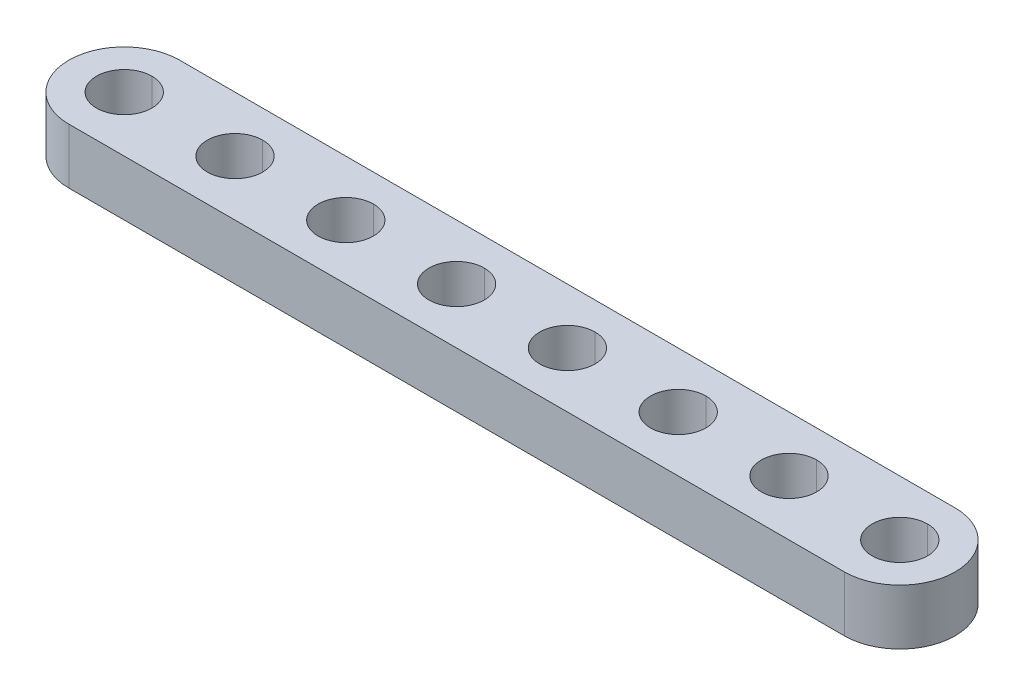
ISO-10303-21;
HEADER;
FILE_DESCRIPTION(('STEP AP214'),'2;1');
FILE_NAME('part.step','',(''),(''),'','','');
FILE_SCHEMA(('AUTOMOTIVE_DESIGN { 1 0 10303 214 1 1 1 1 }'));
ENDSEC;
DATA;
#1=APPLICATION_CONTEXT('core data for automotive mechanical design processes');
#2=APPLICATION_PROTOCOL_DEFINITION('international standard','automotive_design',2000,#1);
#3=PRODUCT_CONTEXT('',#1,'mechanical');
#4=PRODUCT('Part','Part','',(#3));
#5=PRODUCT_RELATED_PRODUCT_CATEGORY('part','',(#4));
#6=PRODUCT_DEFINITION_FORMATION('','',#4);
#7=PRODUCT_DEFINITION_CONTEXT('part definition',#1,'design');
#8=PRODUCT_DEFINITION('design','',#6,#7);
#9=PRODUCT_DEFINITION_SHAPE('','',#8);
#10=(LENGTH_UNIT() NAMED_UNIT(*) SI_UNIT(.MILLI.,.METRE.));
#11=(NAMED_UNIT(*) PLANE_ANGLE_UNIT() SI_UNIT($,.RADIAN.));
#12=(NAMED_UNIT(*) SI_UNIT($,.STERADIAN.) SOLID_ANGLE_UNIT());
#13=UNCERTAINTY_MEASURE_WITH_UNIT(LENGTH_MEASURE(1.E-05),#10,'distance_accuracy_value','');
#14=(GEOMETRIC_REPRESENTATION_CONTEXT(3) GLOBAL_UNCERTAINTY_ASSIGNED_CONTEXT((#13)) GLOBAL_UNIT_ASSIGNED_CONTEXT((#10,
#11,#12)) REPRESENTATION_CONTEXT('',''));
#15=CARTESIAN_POINT('',(0.,0.,0.));
#16=DIRECTION('',(0.,0.,1.));
#17=DIRECTION('',(1.,0.,0.));
#18=AXIS2_PLACEMENT_3D('',#15,#16,#17);
#19=CARTESIAN_POINT('',(28.,4.,0.));
#20=DIRECTION('',(0.,1.,0.));
#21=DIRECTION('',(0.,0.,1.));
#22=AXIS2_PLACEMENT_3D('',#19,#20,#21);
#23=CYLINDRICAL_SURFACE('',#22,2.);
#24=DIRECTION('',(0.,1.,0.));
#25=VECTOR('',#24,1.);
#26=CARTESIAN_POINT('',(28.,4.,-2.));
#27=LINE('',#26,#25);
#28=CARTESIAN_POINT('',(28.,0.,-2.));
#29=VERTEX_POINT('',#28);
#30=CARTESIAN_POINT('',(28.,4.,-2.));
#31=VERTEX_POINT('',#30);
#32=EDGE_CURVE('E223',#29,#31,#27,.T.);
#33=ORIENTED_EDGE('',*,*,#32,.F.);
#34=CARTESIAN_POINT('',(28.,0.,0.));
#35=DIRECTION('',(0.,1.,0.));
#36=DIRECTION('',(0.,0.,1.));
#37=AXIS2_PLACEMENT_3D('',#34,#35,#36);
#38=CIRCLE('',#37,2.);
#39=CARTESIAN_POINT('',(28.,0.,2.));
#40=VERTEX_POINT('',#39);
#41=EDGE_CURVE('E323',#40,#29,#38,.T.);
#42=ORIENTED_EDGE('',*,*,#41,.F.);
#43=DIRECTION('',(0.,1.,0.));
#44=VECTOR('',#43,1.);
#45=CARTESIAN_POINT('',(28.,4.,2.));
#46=LINE('',#45,#44);
#47=CARTESIAN_POINT('',(28.,4.,2.));
#48=VERTEX_POINT('',#47);
#49=EDGE_CURVE('E302',#40,#48,#46,.T.);
#50=ORIENTED_EDGE('',*,*,#49,.T.);
#51=CARTESIAN_POINT('',(28.,4.,0.));
#52=DIRECTION('',(0.,1.,0.));
#53=DIRECTION('',(0.,0.,1.));
#54=AXIS2_PLACEMENT_3D('',#51,#52,#53);
#55=CIRCLE('',#54,2.);
#56=EDGE_CURVE('E229',#48,#31,#55,.T.);
#57=ORIENTED_EDGE('',*,*,#56,.T.);
#58=EDGE_LOOP('',(#33,#42,#50,#57));
#59=FACE_BOUND('',#58,.T.);
#60=ADVANCED_FACE('F15',(#59),#23,.F.);
#61=CARTESIAN_POINT('',(20.,4.,0.));
#62=DIRECTION('',(0.,1.,0.));
#63=DIRECTION('',(0.,0.,1.));
#64=AXIS2_PLACEMENT_3D('',#61,#62,#63);
#65=CYLINDRICAL_SURFACE('',#64,2.);
#66=DIRECTION('',(0.,1.,0.));
#67=VECTOR('',#66,1.);
#68=CARTESIAN_POINT('',(20.,4.,-2.));
#69=LINE('',#68,#67);
#70=CARTESIAN_POINT('',(20.,0.,-2.));
#71=VERTEX_POINT('',#70);
#72=CARTESIAN_POINT('',(20.,4.,-2.));
#73=VERTEX_POINT('',#72);
#74=EDGE_CURVE('E416',#71,#73,#69,.T.);
#75=ORIENTED_EDGE('',*,*,#74,.F.);
#76=CARTESIAN_POINT('',(20.,0.,0.));
#77=DIRECTION('',(0.,1.,0.));
#78=DIRECTION('',(0.,0.,1.));
#79=AXIS2_PLACEMENT_3D('',#76,#77,#78);
#80=CIRCLE('',#79,2.);
#81=CARTESIAN_POINT('',(20.,0.,2.));
#82=VERTEX_POINT('',#81);
#83=EDGE_CURVE('E484',#82,#71,#80,.T.);
#84=ORIENTED_EDGE('',*,*,#83,.F.);
#85=DIRECTION('',(0.,1.,0.));
#86=VECTOR('',#85,1.);
#87=CARTESIAN_POINT('',(20.,4.,2.));
#88=LINE('',#87,#86);
#89=CARTESIAN_POINT('',(20.,4.,2.));
#90=VERTEX_POINT('',#89);
#91=EDGE_CURVE('E426',#82,#90,#88,.T.);
#92=ORIENTED_EDGE('',*,*,#91,.T.);
#93=CARTESIAN_POINT('',(20.,4.,0.));
#94=DIRECTION('',(0.,1.,0.));
#95=DIRECTION('',(0.,0.,1.));
#96=AXIS2_PLACEMENT_3D('',#93,#94,#95);
#97=CIRCLE('',#96,2.);
#98=EDGE_CURVE('E232',#90,#73,#97,.T.);
#99=ORIENTED_EDGE('',*,*,#98,.T.);
#100=EDGE_LOOP('',(#75,#84,#92,#99));
#101=FACE_BOUND('',#100,.T.);
#102=ADVANCED_FACE('F344',(#101),#65,.F.);
#103=CARTESIAN_POINT('',(12.,4.,0.));
#104=DIRECTION('',(0.,1.,0.));
#105=DIRECTION('',(0.,0.,1.));
#106=AXIS2_PLACEMENT_3D('',#103,#104,#105);
#107=CYLINDRICAL_SURFACE('',#106,2.);
#108=DIRECTION('',(0.,1.,0.));
#109=VECTOR('',#108,1.);
#110=CARTESIAN_POINT('',(12.,4.,-2.));
#111=LINE('',#110,#109);
#112=CARTESIAN_POINT('',(12.,0.,-2.));
#113=VERTEX_POINT('',#112);
#114=CARTESIAN_POINT('',(12.,4.,-2.));
#115=VERTEX_POINT('',#114);
#116=EDGE_CURVE('E286',#113,#115,#111,.T.);
#117=ORIENTED_EDGE('',*,*,#116,.F.);
#118=CARTESIAN_POINT('',(12.,0.,0.));
#119=DIRECTION('',(0.,1.,0.));
#120=DIRECTION('',(0.,0.,1.));
#121=AXIS2_PLACEMENT_3D('',#118,#119,#120);
#122=CIRCLE('',#121,2.);
#123=CARTESIAN_POINT('',(12.,0.,2.));
#124=VERTEX_POINT('',#123);
#125=EDGE_CURVE('E445',#124,#113,#122,.T.);
#126=ORIENTED_EDGE('',*,*,#125,.F.);
#127=DIRECTION('',(0.,1.,0.));
#128=VECTOR('',#127,1.);
#129=CARTESIAN_POINT('',(12.,4.,2.));
#130=LINE('',#129,#128);
#131=CARTESIAN_POINT('',(12.,4.,2.));
#132=VERTEX_POINT('',#131);
#133=EDGE_CURVE('E215',#124,#132,#130,.T.);
#134=ORIENTED_EDGE('',*,*,#133,.T.);
#135=CARTESIAN_POINT('',(12.,4.,0.));
#136=DIRECTION('',(0.,1.,0.));
#137=DIRECTION('',(0.,0.,1.));
#138=AXIS2_PLACEMENT_3D('',#135,#136,#137);
#139=CIRCLE('',#138,2.);
#140=EDGE_CURVE('E197',#132,#115,#139,.T.);
#141=ORIENTED_EDGE('',*,*,#140,.T.);
#142=EDGE_LOOP('',(#117,#126,#134,#141));
#143=FACE_BOUND('',#142,.T.);
#144=ADVANCED_FACE('F349',(#143),#107,.F.);
#145=CARTESIAN_POINT('',(4.,4.,0.));
#146=DIRECTION('',(0.,1.,0.));
#147=DIRECTION('',(0.,0.,1.));
#148=AXIS2_PLACEMENT_3D('',#145,#146,#147);
#149=CYLINDRICAL_SURFACE('',#148,2.);
#150=DIRECTION('',(0.,1.,0.));
#151=VECTOR('',#150,1.);
#152=CARTESIAN_POINT('',(4.,4.,-2.));
#153=LINE('',#152,#151);
#154=CARTESIAN_POINT('',(4.,0.,-2.));
#155=VERTEX_POINT('',#154);
#156=CARTESIAN_POINT('',(4.,4.,-2.));
#157=VERTEX_POINT('',#156);
#158=EDGE_CURVE('E189',#155,#157,#153,.T.);
#159=ORIENTED_EDGE('',*,*,#158,.F.);
#160=CARTESIAN_POINT('',(4.,0.,0.));
#161=DIRECTION('',(0.,1.,0.));
#162=DIRECTION('',(0.,0.,1.));
#163=AXIS2_PLACEMENT_3D('',#160,#161,#162);
#164=CIRCLE('',#163,2.);
#165=CARTESIAN_POINT('',(4.,0.,2.));
#166=VERTEX_POINT('',#165);
#167=EDGE_CURVE('E276',#166,#155,#164,.T.);
#168=ORIENTED_EDGE('',*,*,#167,.F.);
#169=DIRECTION('',(0.,1.,0.));
#170=VECTOR('',#169,1.);
#171=CARTESIAN_POINT('',(4.,4.,2.));
#172=LINE('',#171,#170);
#173=CARTESIAN_POINT('',(4.,4.,2.));
#174=VERTEX_POINT('',#173);
#175=EDGE_CURVE('E192',#166,#174,#172,.T.);
#176=ORIENTED_EDGE('',*,*,#175,.T.);
#177=CARTESIAN_POINT('',(4.,4.,0.));
#178=DIRECTION('',(0.,1.,0.));
#179=DIRECTION('',(0.,0.,1.));
#180=AXIS2_PLACEMENT_3D('',#177,#178,#179);
#181=CIRCLE('',#180,2.);
#182=EDGE_CURVE('E185',#174,#157,#181,.T.);
#183=ORIENTED_EDGE('',*,*,#182,.T.);
#184=EDGE_LOOP('',(#159,#168,#176,#183));
#185=FACE_BOUND('',#184,.T.);
#186=ADVANCED_FACE('F187',(#185),#149,.F.);
#187=CARTESIAN_POINT('',(-4.,4.,0.));
#188=DIRECTION('',(0.,1.,0.));
#189=DIRECTION('',(0.,0.,1.));
#190=AXIS2_PLACEMENT_3D('',#187,#188,#189);
#191=CYLINDRICAL_SURFACE('',#190,2.);
#192=DIRECTION('',(0.,1.,0.));
#193=VECTOR('',#192,1.);
#194=CARTESIAN_POINT('',(-4.,4.,-2.));
#195=LINE('',#194,#193);
#196=CARTESIAN_POINT('',(-4.,0.,-2.));
#197=VERTEX_POINT('',#196);
#198=CARTESIAN_POINT('',(-4.,4.,-2.));
#199=VERTEX_POINT('',#198);
#200=EDGE_CURVE('E291',#197,#199,#195,.T.);
#201=ORIENTED_EDGE('',*,*,#200,.F.);
#202=CARTESIAN_POINT('',(-4.,0.,0.));
#203=DIRECTION('',(0.,1.,0.));
#204=DIRECTION('',(0.,0.,1.));
#205=AXIS2_PLACEMENT_3D('',#202,#203,#204);
#206=CIRCLE('',#205,2.);
#207=CARTESIAN_POINT('',(-4.,0.,2.));
#208=VERTEX_POINT('',#207);
#209=EDGE_CURVE('E430',#208,#197,#206,.T.);
#210=ORIENTED_EDGE('',*,*,#209,.F.);
#211=DIRECTION('',(0.,1.,0.));
#212=VECTOR('',#211,1.);
#213=CARTESIAN_POINT('',(-4.,4.,2.));
#214=LINE('',#213,#212);
#215=CARTESIAN_POINT('',(-4.,4.,2.));
#216=VERTEX_POINT('',#215);
#217=EDGE_CURVE('E281',#208,#216,#214,.T.);
#218=ORIENTED_EDGE('',*,*,#217,.T.);
#219=CARTESIAN_POINT('',(-4.,4.,0.));
#220=DIRECTION('',(0.,1.,0.));
#221=DIRECTION('',(0.,0.,1.));
#222=AXIS2_PLACEMENT_3D('',#219,#220,#221);
#223=CIRCLE('',#222,2.);
#224=EDGE_CURVE('E196',#216,#199,#223,.T.);
#225=ORIENTED_EDGE('',*,*,#224,.T.);
#226=EDGE_LOOP('',(#201,#210,#218,#225));
#227=FACE_BOUND('',#226,.T.);
#228=ADVANCED_FACE('F356',(#227),#191,.F.);
#229=CARTESIAN_POINT('',(-12.,4.,0.));
#230=DIRECTION('',(0.,1.,0.));
#231=DIRECTION('',(0.,0.,1.));
#232=AXIS2_PLACEMENT_3D('',#229,#230,#231);
#233=CYLINDRICAL_SURFACE('',#232,2.);
#234=DIRECTION('',(0.,1.,0.));
#235=VECTOR('',#234,1.);
#236=CARTESIAN_POINT('',(-12.,4.,-2.));
#237=LINE('',#236,#235);
#238=CARTESIAN_POINT('',(-12.,0.,-2.));
#239=VERTEX_POINT('',#238);
#240=CARTESIAN_POINT('',(-12.,4.,-2.));
#241=VERTEX_POINT('',#240);
#242=EDGE_CURVE('E280',#239,#241,#237,.T.);
#243=ORIENTED_EDGE('',*,*,#242,.F.);
#244=CARTESIAN_POINT('',(-12.,0.,0.));
#245=DIRECTION('',(0.,1.,0.));
#246=DIRECTION('',(0.,0.,1.));
#247=AXIS2_PLACEMENT_3D('',#244,#245,#246);
#248=CIRCLE('',#247,2.);
#249=CARTESIAN_POINT('',(-12.,0.,2.));
#250=VERTEX_POINT('',#249);
#251=EDGE_CURVE('E132',#250,#239,#248,.T.);
#252=ORIENTED_EDGE('',*,*,#251,.F.);
#253=DIRECTION('',(0.,1.,0.));
#254=VECTOR('',#253,1.);
#255=CARTESIAN_POINT('',(-12.,4.,2.));
#256=LINE('',#255,#254);
#257=CARTESIAN_POINT('',(-12.,4.,2.));
#258=VERTEX_POINT('',#257);
#259=EDGE_CURVE('E242',#250,#258,#256,.T.);
#260=ORIENTED_EDGE('',*,*,#259,.T.);
#261=CARTESIAN_POINT('',(-12.,4.,0.));
#262=DIRECTION('',(0.,1.,0.));
#263=DIRECTION('',(0.,0.,1.));
#264=AXIS2_PLACEMENT_3D('',#261,#262,#263);
#265=CIRCLE('',#264,2.);
#266=EDGE_CURVE('E408',#258,#241,#265,.T.);
#267=ORIENTED_EDGE('',*,*,#266,.T.);
#268=EDGE_LOOP('',(#243,#252,#260,#267));
#269=FACE_BOUND('',#268,.T.);
#270=ADVANCED_FACE('F359',(#269),#233,.F.);
#271=CARTESIAN_POINT('',(-20.,4.,0.));
#272=DIRECTION('',(0.,1.,0.));
#273=DIRECTION('',(0.,0.,1.));
#274=AXIS2_PLACEMENT_3D('',#271,#272,#273);
#275=CYLINDRICAL_SURFACE('',#274,2.);
#276=DIRECTION('',(0.,1.,0.));
#277=VECTOR('',#276,1.);
#278=CARTESIAN_POINT('',(-20.,4.,-2.));
#279=LINE('',#278,#277);
#280=CARTESIAN_POINT('',(-20.,0.,-2.));
#281=VERTEX_POINT('',#280);
#282=CARTESIAN_POINT('',(-20.,4.,-2.));
#283=VERTEX_POINT('',#282);
#284=EDGE_CURVE('E19',#281,#283,#279,.T.);
#285=ORIENTED_EDGE('',*,*,#284,.F.);
#286=CARTESIAN_POINT('',(-20.,0.,0.));
#287=DIRECTION('',(0.,1.,0.));
#288=DIRECTION('',(0.,0.,1.));
#289=AXIS2_PLACEMENT_3D('',#286,#287,#288);
#290=CIRCLE('',#289,2.);
#291=CARTESIAN_POINT('',(-20.,0.,2.));
#292=VERTEX_POINT('',#291);
#293=EDGE_CURVE('E26',#292,#281,#290,.T.);
#294=ORIENTED_EDGE('',*,*,#293,.F.);
#295=DIRECTION('',(0.,1.,0.));
#296=VECTOR('',#295,1.);
#297=CARTESIAN_POINT('',(-20.,4.,2.));
#298=LINE('',#297,#296);
#299=CARTESIAN_POINT('',(-20.,4.,2.));
#300=VERTEX_POINT('',#299);
#301=EDGE_CURVE('E392',#292,#300,#298,.T.);
#302=ORIENTED_EDGE('',*,*,#301,.T.);
#303=CARTESIAN_POINT('',(-20.,4.,0.));
#304=DIRECTION('',(0.,1.,0.));
#305=DIRECTION('',(0.,0.,1.));
#306=AXIS2_PLACEMENT_3D('',#303,#304,#305);
#307=CIRCLE('',#306,2.);
#308=EDGE_CURVE('E410',#300,#283,#307,.T.);
#309=ORIENTED_EDGE('',*,*,#308,.T.);
#310=EDGE_LOOP('',(#285,#294,#302,#309));
#311=FACE_BOUND('',#310,.T.);
#312=ADVANCED_FACE('F362',(#311),#275,.F.);
#313=CARTESIAN_POINT('',(-28.,4.,0.));
#314=DIRECTION('',(0.,1.,0.));
#315=DIRECTION('',(0.,0.,1.));
#316=AXIS2_PLACEMENT_3D('',#313,#314,#315);
#317=CYLINDRICAL_SURFACE('',#316,2.);
#318=DIRECTION('',(0.,1.,0.));
#319=VECTOR('',#318,1.);
#320=CARTESIAN_POINT('',(-28.,4.,-2.));
#321=LINE('',#320,#319);
#322=CARTESIAN_POINT('',(-28.,0.,-2.));
#323=VERTEX_POINT('',#322);
#324=CARTESIAN_POINT('',(-28.,4.,-2.));
#325=VERTEX_POINT('',#324);
#326=EDGE_CURVE('E233',#323,#325,#321,.T.);
#327=ORIENTED_EDGE('',*,*,#326,.F.);
#328=CARTESIAN_POINT('',(-28.,0.,0.));
#329=DIRECTION('',(0.,1.,0.));
#330=DIRECTION('',(0.,0.,1.));
#331=AXIS2_PLACEMENT_3D('',#328,#329,#330);
#332=CIRCLE('',#331,2.);
#333=CARTESIAN_POINT('',(-28.,0.,2.));
#334=VERTEX_POINT('',#333);
#335=EDGE_CURVE('E10',#334,#323,#332,.T.);
#336=ORIENTED_EDGE('',*,*,#335,.F.);
#337=DIRECTION('',(0.,1.,0.));
#338=VECTOR('',#337,1.);
#339=CARTESIAN_POINT('',(-28.,4.,2.));
#340=LINE('',#339,#338);
#341=CARTESIAN_POINT('',(-28.,4.,2.));
#342=VERTEX_POINT('',#341);
#343=EDGE_CURVE('E294',#334,#342,#340,.T.);
#344=ORIENTED_EDGE('',*,*,#343,.T.);
#345=CARTESIAN_POINT('',(-28.,4.,0.));
#346=DIRECTION('',(0.,1.,0.));
#347=DIRECTION('',(0.,0.,1.));
#348=AXIS2_PLACEMENT_3D('',#345,#346,#347);
#349=CIRCLE('',#348,2.);
#350=EDGE_CURVE('E386',#342,#325,#349,.T.);
#351=ORIENTED_EDGE('',*,*,#350,.T.);
#352=EDGE_LOOP('',(#327,#336,#344,#351));
#353=FACE_BOUND('',#352,.T.);
#354=ADVANCED_FACE('F337',(#353),#317,.F.);
#355=CARTESIAN_POINT('',(-28.,0.,0.));
#356=DIRECTION('',(0.,1.,0.));
#357=DIRECTION('',(1.,0.,0.));
#358=AXIS2_PLACEMENT_3D('',#355,#356,#357);
#359=PLANE('',#358);
#360=ORIENTED_EDGE('',*,*,#335,.T.);
#361=CARTESIAN_POINT('',(-28.,0.,0.));
#362=DIRECTION('',(0.,1.,0.));
#363=DIRECTION('',(0.,0.,1.));
#364=AXIS2_PLACEMENT_3D('',#361,#362,#363);
#365=CIRCLE('',#364,2.);
#366=EDGE_CURVE('E238',#323,#334,#365,.T.);
#367=ORIENTED_EDGE('',*,*,#366,.T.);
#368=EDGE_LOOP('',(#360,#367));
#369=FACE_BOUND('',#368,.T.);
#370=ORIENTED_EDGE('',*,*,#293,.T.);
#371=CARTESIAN_POINT('',(-20.,0.,0.));
#372=DIRECTION('',(0.,1.,0.));
#373=DIRECTION('',(0.,0.,1.));
#374=AXIS2_PLACEMENT_3D('',#371,#372,#373);
#375=CIRCLE('',#374,2.);
#376=EDGE_CURVE('E239',#281,#292,#375,.T.);
#377=ORIENTED_EDGE('',*,*,#376,.T.);
#378=EDGE_LOOP('',(#370,#377));
#379=FACE_BOUND('',#378,.T.);
#380=ORIENTED_EDGE('',*,*,#251,.T.);
#381=CARTESIAN_POINT('',(-12.,0.,0.));
#382=DIRECTION('',(0.,1.,0.));
#383=DIRECTION('',(0.,0.,1.));
#384=AXIS2_PLACEMENT_3D('',#381,#382,#383);
#385=CIRCLE('',#384,2.);
#386=EDGE_CURVE('E278',#239,#250,#385,.T.);
#387=ORIENTED_EDGE('',*,*,#386,.T.);
#388=EDGE_LOOP('',(#380,#387));
#389=FACE_BOUND('',#388,.T.);
#390=ORIENTED_EDGE('',*,*,#209,.T.);
#391=CARTESIAN_POINT('',(-4.,0.,0.));
#392=DIRECTION('',(0.,1.,0.));
#393=DIRECTION('',(0.,0.,1.));
#394=AXIS2_PLACEMENT_3D('',#391,#392,#393);
#395=CIRCLE('',#394,2.);
#396=EDGE_CURVE('E287',#197,#208,#395,.T.);
#397=ORIENTED_EDGE('',*,*,#396,.T.);
#398=EDGE_LOOP('',(#390,#397));
#399=FACE_BOUND('',#398,.T.);
#400=ORIENTED_EDGE('',*,*,#167,.T.);
#401=CARTESIAN_POINT('',(4.,0.,0.));
#402=DIRECTION('',(0.,1.,0.));
#403=DIRECTION('',(0.,0.,1.));
#404=AXIS2_PLACEMENT_3D('',#401,#402,#403);
#405=CIRCLE('',#404,2.);
#406=EDGE_CURVE('E207',#155,#166,#405,.T.);
#407=ORIENTED_EDGE('',*,*,#406,.T.);
#408=EDGE_LOOP('',(#400,#407));
#409=FACE_BOUND('',#408,.T.);
#410=ORIENTED_EDGE('',*,*,#125,.T.);
#411=CARTESIAN_POINT('',(12.,0.,0.));
#412=DIRECTION('',(0.,1.,0.));
#413=DIRECTION('',(0.,0.,1.));
#414=AXIS2_PLACEMENT_3D('',#411,#412,#413);
#415=CIRCLE('',#414,2.);
#416=EDGE_CURVE('E420',#113,#124,#415,.T.);
#417=ORIENTED_EDGE('',*,*,#416,.T.);
#418=EDGE_LOOP('',(#410,#417));
#419=FACE_BOUND('',#418,.T.);
#420=ORIENTED_EDGE('',*,*,#83,.T.);
#421=CARTESIAN_POINT('',(20.,0.,0.));
#422=DIRECTION('',(0.,1.,0.));
#423=DIRECTION('',(0.,0.,1.));
#424=AXIS2_PLACEMENT_3D('',#421,#422,#423);
#425=CIRCLE('',#424,2.);
#426=EDGE_CURVE('E412',#71,#82,#425,.T.);
#427=ORIENTED_EDGE('',*,*,#426,.T.);
#428=EDGE_LOOP('',(#420,#427));
#429=FACE_BOUND('',#428,.T.);
#430=ORIENTED_EDGE('',*,*,#41,.T.);
#431=CARTESIAN_POINT('',(28.,0.,0.));
#432=DIRECTION('',(0.,1.,0.));
#433=DIRECTION('',(0.,0.,1.));
#434=AXIS2_PLACEMENT_3D('',#431,#432,#433);
#435=CIRCLE('',#434,2.);
#436=EDGE_CURVE('E220',#29,#40,#435,.T.);
#437=ORIENTED_EDGE('',*,*,#436,.T.);
#438=EDGE_LOOP('',(#430,#437));
#439=FACE_BOUND('',#438,.T.);
#440=CARTESIAN_POINT('',(-28.,0.,0.));
#441=DIRECTION('',(0.,1.,0.));
#442=DIRECTION('',(0.,0.,1.));
#443=AXIS2_PLACEMENT_3D('',#440,#441,#442);
#444=CIRCLE('',#443,4.);
#445=CARTESIAN_POINT('',(-28.,0.,-4.));
#446=VERTEX_POINT('',#445);
#447=CARTESIAN_POINT('',(-28.,0.,4.));
#448=VERTEX_POINT('',#447);
#449=EDGE_CURVE('E272',#446,#448,#444,.T.);
#450=ORIENTED_EDGE('',*,*,#449,.F.);
#451=DIRECTION('',(-1.,0.,0.));
#452=VECTOR('',#451,1.);
#453=CARTESIAN_POINT('',(-28.,0.,-4.));
#454=LINE('',#453,#452);
#455=CARTESIAN_POINT('',(28.,0.,-4.));
#456=VERTEX_POINT('',#455);
#457=EDGE_CURVE('E227',#456,#446,#454,.T.);
#458=ORIENTED_EDGE('',*,*,#457,.F.);
#459=CARTESIAN_POINT('',(28.,0.,0.));
#460=DIRECTION('',(0.,1.,0.));
#461=DIRECTION('',(0.,0.,1.));
#462=AXIS2_PLACEMENT_3D('',#459,#460,#461);
#463=CIRCLE('',#462,4.);
#464=CARTESIAN_POINT('',(28.,0.,4.));
#465=VERTEX_POINT('',#464);
#466=EDGE_CURVE('E307',#465,#456,#463,.T.);
#467=ORIENTED_EDGE('',*,*,#466,.F.);
#468=DIRECTION('',(1.,0.,0.));
#469=VECTOR('',#468,1.);
#470=CARTESIAN_POINT('',(-28.,0.,4.));
#471=LINE('',#470,#469);
#472=EDGE_CURVE('E246',#448,#465,#471,.T.);
#473=ORIENTED_EDGE('',*,*,#472,.F.);
#474=EDGE_LOOP('',(#450,#458,#467,#473));
#475=FACE_BOUND('',#474,.T.);
#476=ADVANCED_FACE('F327',(#369,#379,#389,#399,#409,#419,#429,#439,#475),#359,.F.);
#477=CARTESIAN_POINT('',(-28.,4.,0.));
#478=DIRECTION('',(0.,1.,0.));
#479=DIRECTION('',(1.,0.,0.));
#480=AXIS2_PLACEMENT_3D('',#477,#478,#479);
#481=PLANE('',#480);
#482=ORIENTED_EDGE('',*,*,#350,.F.);
#483=CARTESIAN_POINT('',(-28.,4.,0.));
#484=DIRECTION('',(0.,1.,0.));
#485=DIRECTION('',(0.,0.,1.));
#486=AXIS2_PLACEMENT_3D('',#483,#484,#485);
#487=CIRCLE('',#486,2.);
#488=EDGE_CURVE('E237',#325,#342,#487,.T.);
#489=ORIENTED_EDGE('',*,*,#488,.F.);
#490=EDGE_LOOP('',(#482,#489));
#491=FACE_BOUND('',#490,.T.);
#492=ORIENTED_EDGE('',*,*,#308,.F.);
#493=CARTESIAN_POINT('',(-20.,4.,0.));
#494=DIRECTION('',(0.,1.,0.));
#495=DIRECTION('',(0.,0.,1.));
#496=AXIS2_PLACEMENT_3D('',#493,#494,#495);
#497=CIRCLE('',#496,2.);
#498=EDGE_CURVE('E400',#283,#300,#497,.T.);
#499=ORIENTED_EDGE('',*,*,#498,.F.);
#500=EDGE_LOOP('',(#492,#499));
#501=FACE_BOUND('',#500,.T.);
#502=ORIENTED_EDGE('',*,*,#266,.F.);
#503=CARTESIAN_POINT('',(-12.,4.,0.));
#504=DIRECTION('',(0.,1.,0.));
#505=DIRECTION('',(0.,0.,1.));
#506=AXIS2_PLACEMENT_3D('',#503,#504,#505);
#507=CIRCLE('',#506,2.);
#508=EDGE_CURVE('E306',#241,#258,#507,.T.);
#509=ORIENTED_EDGE('',*,*,#508,.F.);
#510=EDGE_LOOP('',(#502,#509));
#511=FACE_BOUND('',#510,.T.);
#512=ORIENTED_EDGE('',*,*,#224,.F.);
#513=CARTESIAN_POINT('',(-4.,4.,0.));
#514=DIRECTION('',(0.,1.,0.));
#515=DIRECTION('',(0.,0.,1.));
#516=AXIS2_PLACEMENT_3D('',#513,#514,#515);
#517=CIRCLE('',#516,2.);
#518=EDGE_CURVE('E464',#199,#216,#517,.T.);
#519=ORIENTED_EDGE('',*,*,#518,.F.);
#520=EDGE_LOOP('',(#512,#519));
#521=FACE_BOUND('',#520,.T.);
#522=ORIENTED_EDGE('',*,*,#182,.F.);
#523=CARTESIAN_POINT('',(4.,4.,0.));
#524=DIRECTION('',(0.,1.,0.));
#525=DIRECTION('',(0.,0.,1.));
#526=AXIS2_PLACEMENT_3D('',#523,#524,#525);
#527=CIRCLE('',#526,2.);
#528=EDGE_CURVE('E199',#157,#174,#527,.T.);
#529=ORIENTED_EDGE('',*,*,#528,.F.);
#530=EDGE_LOOP('',(#522,#529));
#531=FACE_BOUND('',#530,.T.);
#532=ORIENTED_EDGE('',*,*,#140,.F.);
#533=CARTESIAN_POINT('',(12.,4.,0.));
#534=DIRECTION('',(0.,1.,0.));
#535=DIRECTION('',(0.,0.,1.));
#536=AXIS2_PLACEMENT_3D('',#533,#534,#535);
#537=CIRCLE('',#536,2.);
#538=EDGE_CURVE('E282',#115,#132,#537,.T.);
#539=ORIENTED_EDGE('',*,*,#538,.F.);
#540=EDGE_LOOP('',(#532,#539));
#541=FACE_BOUND('',#540,.T.);
#542=ORIENTED_EDGE('',*,*,#98,.F.);
#543=CARTESIAN_POINT('',(20.,4.,0.));
#544=DIRECTION('',(0.,1.,0.));
#545=DIRECTION('',(0.,0.,1.));
#546=AXIS2_PLACEMENT_3D('',#543,#544,#545);
#547=CIRCLE('',#546,2.);
#548=EDGE_CURVE('E451',#73,#90,#547,.T.);
#549=ORIENTED_EDGE('',*,*,#548,.F.);
#550=EDGE_LOOP('',(#542,#549));
#551=FACE_BOUND('',#550,.T.);
#552=ORIENTED_EDGE('',*,*,#56,.F.);
#553=CARTESIAN_POINT('',(28.,4.,0.));
#554=DIRECTION('',(0.,1.,0.));
#555=DIRECTION('',(0.,0.,1.));
#556=AXIS2_PLACEMENT_3D('',#553,#554,#555);
#557=CIRCLE('',#556,2.);
#558=EDGE_CURVE('E298',#31,#48,#557,.T.);
#559=ORIENTED_EDGE('',*,*,#558,.F.);
#560=EDGE_LOOP('',(#552,#559));
#561=FACE_BOUND('',#560,.T.);
#562=CARTESIAN_POINT('',(-28.,4.,0.));
#563=DIRECTION('',(0.,1.,0.));
#564=DIRECTION('',(0.,0.,1.));
#565=AXIS2_PLACEMENT_3D('',#562,#563,#564);
#566=CIRCLE('',#565,4.);
#567=CARTESIAN_POINT('',(-28.,4.,-4.));
#568=VERTEX_POINT('',#567);
#569=CARTESIAN_POINT('',(-28.,4.,4.));
#570=VERTEX_POINT('',#569);
#571=EDGE_CURVE('E247',#568,#570,#566,.T.);
#572=ORIENTED_EDGE('',*,*,#571,.T.);
#573=DIRECTION('',(1.,0.,0.));
#574=VECTOR('',#573,1.);
#575=CARTESIAN_POINT('',(-28.,4.,4.));
#576=LINE('',#575,#574);
#577=CARTESIAN_POINT('',(28.,4.,4.));
#578=VERTEX_POINT('',#577);
#579=EDGE_CURVE('E310',#570,#578,#576,.T.);
#580=ORIENTED_EDGE('',*,*,#579,.T.);
#581=CARTESIAN_POINT('',(28.,4.,0.));
#582=DIRECTION('',(0.,1.,0.));
#583=DIRECTION('',(0.,0.,1.));
#584=AXIS2_PLACEMENT_3D('',#581,#582,#583);
#585=CIRCLE('',#584,4.);
#586=CARTESIAN_POINT('',(28.,4.,-4.));
#587=VERTEX_POINT('',#586);
#588=EDGE_CURVE('E224',#578,#587,#585,.T.);
#589=ORIENTED_EDGE('',*,*,#588,.T.);
#590=DIRECTION('',(-1.,0.,0.));
#591=VECTOR('',#590,1.);
#592=CARTESIAN_POINT('',(-28.,4.,-4.));
#593=LINE('',#592,#591);
#594=EDGE_CURVE('E41',#587,#568,#593,.T.);
#595=ORIENTED_EDGE('',*,*,#594,.T.);
#596=EDGE_LOOP('',(#572,#580,#589,#595));
#597=FACE_BOUND('',#596,.T.);
#598=ADVANCED_FACE('F200',(#491,#501,#511,#521,#531,#541,#551,#561,#597),#481,.T.);
#599=CARTESIAN_POINT('',(-28.,4.,-4.));
#600=DIRECTION('',(0.,0.,1.));
#601=DIRECTION('',(1.,0.,0.));
#602=AXIS2_PLACEMENT_3D('',#599,#600,#601);
#603=PLANE('',#602);
#604=ORIENTED_EDGE('',*,*,#457,.T.);
#605=DIRECTION('',(0.,-1.,0.));
#606=VECTOR('',#605,1.);
#607=CARTESIAN_POINT('',(-28.,4.,-4.));
#608=LINE('',#607,#606);
#609=EDGE_CURVE('E243',#568,#446,#608,.T.);
#610=ORIENTED_EDGE('',*,*,#609,.F.);
#611=ORIENTED_EDGE('',*,*,#594,.F.);
#612=DIRECTION('',(0.,-1.,0.));
#613=VECTOR('',#612,1.);
#614=CARTESIAN_POINT('',(28.,4.,-4.));
#615=LINE('',#614,#613);
#616=EDGE_CURVE('E228',#587,#456,#615,.T.);
#617=ORIENTED_EDGE('',*,*,#616,.T.);
#618=EDGE_LOOP('',(#604,#610,#611,#617));
#619=FACE_BOUND('',#618,.T.);
#620=ADVANCED_FACE('F326',(#619),#603,.F.);
#621=CARTESIAN_POINT('',(28.,4.,0.));
#622=DIRECTION('',(0.,-1.,0.));
#623=DIRECTION('',(0.,0.,-1.));
#624=AXIS2_PLACEMENT_3D('',#621,#622,#623);
#625=CYLINDRICAL_SURFACE('',#624,4.);
#626=ORIENTED_EDGE('',*,*,#466,.T.);
#627=ORIENTED_EDGE('',*,*,#616,.F.);
#628=ORIENTED_EDGE('',*,*,#588,.F.);
#629=DIRECTION('',(0.,-1.,0.));
#630=VECTOR('',#629,1.);
#631=CARTESIAN_POINT('',(28.,4.,4.));
#632=LINE('',#631,#630);
#633=EDGE_CURVE('E257',#578,#465,#632,.T.);
#634=ORIENTED_EDGE('',*,*,#633,.T.);
#635=EDGE_LOOP('',(#626,#627,#628,#634));
#636=FACE_BOUND('',#635,.T.);
#637=ADVANCED_FACE('F335',(#636),#625,.T.);
#638=CARTESIAN_POINT('',(-28.,4.,4.));
#639=DIRECTION('',(0.,0.,-1.));
#640=DIRECTION('',(0.,-1.,0.));
#641=AXIS2_PLACEMENT_3D('',#638,#639,#640);
#642=PLANE('',#641);
#643=ORIENTED_EDGE('',*,*,#472,.T.);
#644=ORIENTED_EDGE('',*,*,#633,.F.);
#645=ORIENTED_EDGE('',*,*,#579,.F.);
#646=DIRECTION('',(0.,-1.,0.));
#647=VECTOR('',#646,1.);
#648=CARTESIAN_POINT('',(-28.,4.,4.));
#649=LINE('',#648,#647);
#650=EDGE_CURVE('E261',#570,#448,#649,.T.);
#651=ORIENTED_EDGE('',*,*,#650,.T.);
#652=EDGE_LOOP('',(#643,#644,#645,#651));
#653=FACE_BOUND('',#652,.T.);
#654=ADVANCED_FACE('F612',(#653),#642,.F.);
#655=CARTESIAN_POINT('',(-28.,4.,0.));
#656=DIRECTION('',(0.,-1.,0.));
#657=DIRECTION('',(0.,0.,-1.));
#658=AXIS2_PLACEMENT_3D('',#655,#656,#657);
#659=CYLINDRICAL_SURFACE('',#658,4.);
#660=ORIENTED_EDGE('',*,*,#449,.T.);
#661=ORIENTED_EDGE('',*,*,#650,.F.);
#662=ORIENTED_EDGE('',*,*,#571,.F.);
#663=ORIENTED_EDGE('',*,*,#609,.T.);
#664=EDGE_LOOP('',(#660,#661,#662,#663));
#665=FACE_BOUND('',#664,.T.);
#666=ADVANCED_FACE('F616',(#665),#659,.T.);
#667=CARTESIAN_POINT('',(-28.,4.,0.));
#668=DIRECTION('',(0.,1.,0.));
#669=DIRECTION('',(0.,0.,1.));
#670=AXIS2_PLACEMENT_3D('',#667,#668,#669);
#671=CYLINDRICAL_SURFACE('',#670,2.);
#672=ORIENTED_EDGE('',*,*,#366,.F.);
#673=ORIENTED_EDGE('',*,*,#326,.T.);
#674=ORIENTED_EDGE('',*,*,#488,.T.);
#675=ORIENTED_EDGE('',*,*,#343,.F.);
#676=EDGE_LOOP('',(#672,#673,#674,#675));
#677=FACE_BOUND('',#676,.T.);
#678=ADVANCED_FACE('F17',(#677),#671,.F.);
#679=CARTESIAN_POINT('',(-20.,4.,0.));
#680=DIRECTION('',(0.,1.,0.));
#681=DIRECTION('',(0.,0.,1.));
#682=AXIS2_PLACEMENT_3D('',#679,#680,#681);
#683=CYLINDRICAL_SURFACE('',#682,2.);
#684=ORIENTED_EDGE('',*,*,#376,.F.);
#685=ORIENTED_EDGE('',*,*,#284,.T.);
#686=ORIENTED_EDGE('',*,*,#498,.T.);
#687=ORIENTED_EDGE('',*,*,#301,.F.);
#688=EDGE_LOOP('',(#684,#685,#686,#687));
#689=FACE_BOUND('',#688,.T.);
#690=ADVANCED_FACE('F622',(#689),#683,.F.);
#691=CARTESIAN_POINT('',(-12.,4.,0.));
#692=DIRECTION('',(0.,1.,0.));
#693=DIRECTION('',(0.,0.,1.));
#694=AXIS2_PLACEMENT_3D('',#691,#692,#693);
#695=CYLINDRICAL_SURFACE('',#694,2.);
#696=ORIENTED_EDGE('',*,*,#386,.F.);
#697=ORIENTED_EDGE('',*,*,#242,.T.);
#698=ORIENTED_EDGE('',*,*,#508,.T.);
#699=ORIENTED_EDGE('',*,*,#259,.F.);
#700=EDGE_LOOP('',(#696,#697,#698,#699));
#701=FACE_BOUND('',#700,.T.);
#702=ADVANCED_FACE('F353',(#701),#695,.F.);
#703=CARTESIAN_POINT('',(-4.,4.,0.));
#704=DIRECTION('',(0.,1.,0.));
#705=DIRECTION('',(0.,0.,1.));
#706=AXIS2_PLACEMENT_3D('',#703,#704,#705);
#707=CYLINDRICAL_SURFACE('',#706,2.);
#708=ORIENTED_EDGE('',*,*,#396,.F.);
#709=ORIENTED_EDGE('',*,*,#200,.T.);
#710=ORIENTED_EDGE('',*,*,#518,.T.);
#711=ORIENTED_EDGE('',*,*,#217,.F.);
#712=EDGE_LOOP('',(#708,#709,#710,#711));
#713=FACE_BOUND('',#712,.T.);
#714=ADVANCED_FACE('F364',(#713),#707,.F.);
#715=CARTESIAN_POINT('',(4.,4.,0.));
#716=DIRECTION('',(0.,1.,0.));
#717=DIRECTION('',(0.,0.,1.));
#718=AXIS2_PLACEMENT_3D('',#715,#716,#717);
#719=CYLINDRICAL_SURFACE('',#718,2.);
#720=ORIENTED_EDGE('',*,*,#406,.F.);
#721=ORIENTED_EDGE('',*,*,#158,.T.);
#722=ORIENTED_EDGE('',*,*,#528,.T.);
#723=ORIENTED_EDGE('',*,*,#175,.F.);
#724=EDGE_LOOP('',(#720,#721,#722,#723));
#725=FACE_BOUND('',#724,.T.);
#726=ADVANCED_FACE('F205',(#725),#719,.F.);
#727=CARTESIAN_POINT('',(12.,4.,0.));
#728=DIRECTION('',(0.,1.,0.));
#729=DIRECTION('',(0.,0.,1.));
#730=AXIS2_PLACEMENT_3D('',#727,#728,#729);
#731=CYLINDRICAL_SURFACE('',#730,2.);
#732=ORIENTED_EDGE('',*,*,#416,.F.);
#733=ORIENTED_EDGE('',*,*,#116,.T.);
#734=ORIENTED_EDGE('',*,*,#538,.T.);
#735=ORIENTED_EDGE('',*,*,#133,.F.);
#736=EDGE_LOOP('',(#732,#733,#734,#735));
#737=FACE_BOUND('',#736,.T.);
#738=ADVANCED_FACE('F371',(#737),#731,.F.);
#739=CARTESIAN_POINT('',(20.,4.,0.));
#740=DIRECTION('',(0.,1.,0.));
#741=DIRECTION('',(0.,0.,1.));
#742=AXIS2_PLACEMENT_3D('',#739,#740,#741);
#743=CYLINDRICAL_SURFACE('',#742,2.);
#744=ORIENTED_EDGE('',*,*,#426,.F.);
#745=ORIENTED_EDGE('',*,*,#74,.T.);
#746=ORIENTED_EDGE('',*,*,#548,.T.);
#747=ORIENTED_EDGE('',*,*,#91,.F.);
#748=EDGE_LOOP('',(#744,#745,#746,#747));
#749=FACE_BOUND('',#748,.T.);
#750=ADVANCED_FACE('F373',(#749),#743,.F.);
#751=CARTESIAN_POINT('',(28.,4.,0.));
#752=DIRECTION('',(0.,1.,0.));
#753=DIRECTION('',(0.,0.,1.));
#754=AXIS2_PLACEMENT_3D('',#751,#752,#753);
#755=CYLINDRICAL_SURFACE('',#754,2.);
#756=ORIENTED_EDGE('',*,*,#436,.F.);
#757=ORIENTED_EDGE('',*,*,#32,.T.);
#758=ORIENTED_EDGE('',*,*,#558,.T.);
#759=ORIENTED_EDGE('',*,*,#49,.F.);
#760=EDGE_LOOP('',(#756,#757,#758,#759));
#761=FACE_BOUND('',#760,.T.);
#762=ADVANCED_FACE('F318',(#761),#755,.F.);
#763=CLOSED_SHELL('',(#60,#102,#144,#186,#228,#270,#312,#354,#476,#598,#620,#637,#654,#666,#678,
#690,#702,#714,#726,#738,#750,#762));
#764=MANIFOLD_SOLID_BREP('B1',#763);
#765=ADVANCED_BREP_SHAPE_REPRESENTATION('',(#18,#764),#14);
#766=SHAPE_DEFINITION_REPRESENTATION(#9,#765);
ENDSEC;
END-ISO-10303-21;
